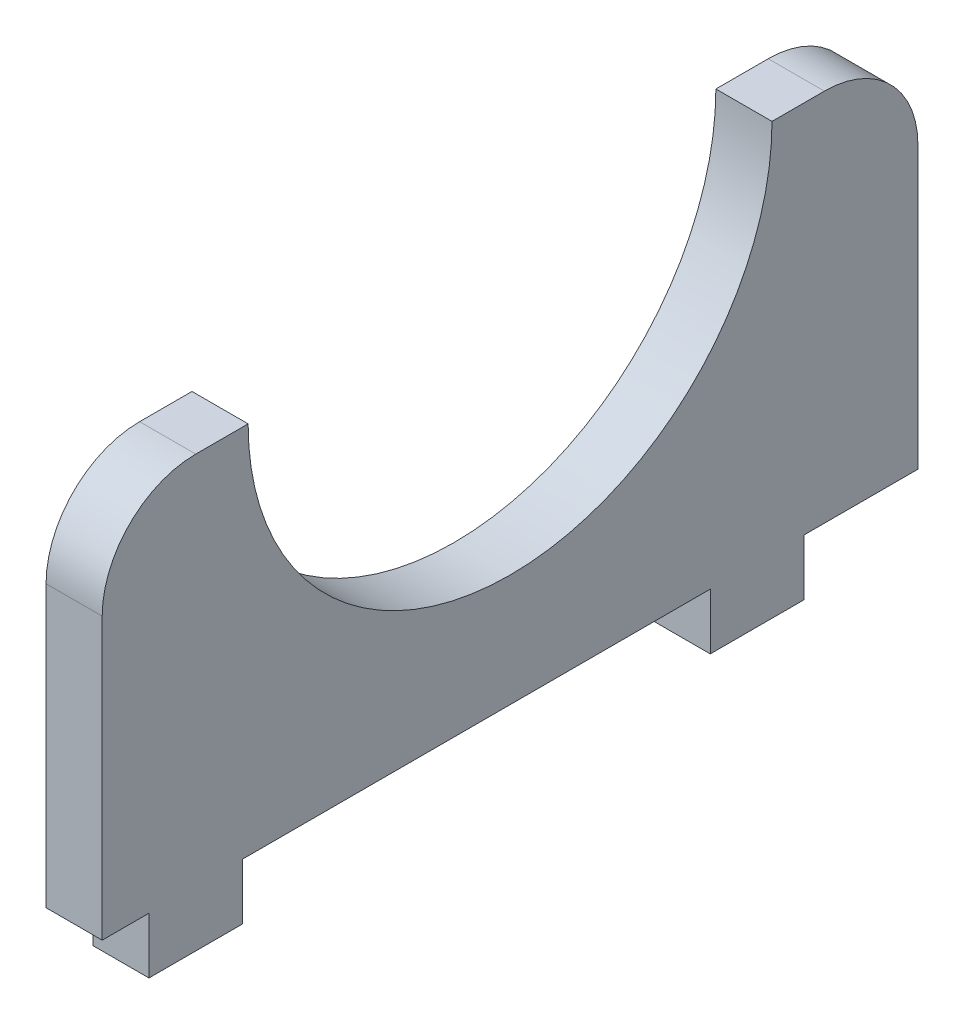
ISO-10303-21;
HEADER;
FILE_DESCRIPTION(('STEP AP214'),'2;1');
FILE_NAME('part.step','',(''),(''),'','','');
FILE_SCHEMA(('AUTOMOTIVE_DESIGN { 1 0 10303 214 1 1 1 1 }'));
ENDSEC;
DATA;
#1=APPLICATION_CONTEXT('core data for automotive mechanical design processes');
#2=APPLICATION_PROTOCOL_DEFINITION('international standard','automotive_design',2000,#1);
#3=PRODUCT_CONTEXT('',#1,'mechanical');
#4=PRODUCT('Part','Part','',(#3));
#5=PRODUCT_RELATED_PRODUCT_CATEGORY('part','',(#4));
#6=PRODUCT_DEFINITION_FORMATION('','',#4);
#7=PRODUCT_DEFINITION_CONTEXT('part definition',#1,'design');
#8=PRODUCT_DEFINITION('design','',#6,#7);
#9=PRODUCT_DEFINITION_SHAPE('','',#8);
#10=(LENGTH_UNIT() NAMED_UNIT(*) SI_UNIT(.MILLI.,.METRE.));
#11=(NAMED_UNIT(*) PLANE_ANGLE_UNIT() SI_UNIT($,.RADIAN.));
#12=(NAMED_UNIT(*) SI_UNIT($,.STERADIAN.) SOLID_ANGLE_UNIT());
#13=UNCERTAINTY_MEASURE_WITH_UNIT(LENGTH_MEASURE(1.E-05),#10,'distance_accuracy_value','');
#14=(GEOMETRIC_REPRESENTATION_CONTEXT(3) GLOBAL_UNCERTAINTY_ASSIGNED_CONTEXT((#13)) GLOBAL_UNIT_ASSIGNED_CONTEXT((#10,
#11,#12)) REPRESENTATION_CONTEXT('',''));
#15=CARTESIAN_POINT('',(0.,0.,0.));
#16=DIRECTION('',(0.,0.,1.));
#17=DIRECTION('',(1.,0.,0.));
#18=AXIS2_PLACEMENT_3D('',#15,#16,#17);
#19=CARTESIAN_POINT('',(3.,-11.75,-13.6));
#20=DIRECTION('',(0.,1.,0.));
#21=DIRECTION('',(0.,0.,1.));
#22=AXIS2_PLACEMENT_3D('',#19,#20,#21);
#23=PLANE('',#22);
#24=DIRECTION('',(-1.,0.,0.));
#25=VECTOR('',#24,1.);
#26=CARTESIAN_POINT('',(3.,-11.75,-2.49999999999999));
#27=LINE('',#26,#25);
#28=CARTESIAN_POINT('',(3.,-11.75,-2.49999999999999));
#29=VERTEX_POINT('',#28);
#30=CARTESIAN_POINT('',(0.,-11.75,-2.49999999999999));
#31=VERTEX_POINT('',#30);
#32=EDGE_CURVE('E58',#29,#31,#27,.T.);
#33=ORIENTED_EDGE('',*,*,#32,.F.);
#34=DIRECTION('',(0.,0.,-1.));
#35=VECTOR('',#34,1.);
#36=CARTESIAN_POINT('',(3.,-11.75,-13.6));
#37=LINE('',#36,#35);
#38=CARTESIAN_POINT('',(3.,-11.75,22.5));
#39=VERTEX_POINT('',#38);
#40=EDGE_CURVE('E172',#39,#29,#37,.T.);
#41=ORIENTED_EDGE('',*,*,#40,.F.);
#42=DIRECTION('',(1.,0.,0.));
#43=VECTOR('',#42,1.);
#44=CARTESIAN_POINT('',(3.,-11.75,22.5));
#45=LINE('',#44,#43);
#46=CARTESIAN_POINT('',(0.,-11.75,22.5));
#47=VERTEX_POINT('',#46);
#48=EDGE_CURVE('E176',#47,#39,#45,.T.);
#49=ORIENTED_EDGE('',*,*,#48,.F.);
#50=DIRECTION('',(0.,0.,-1.));
#51=VECTOR('',#50,1.);
#52=CARTESIAN_POINT('',(0.,-11.75,-13.6));
#53=LINE('',#52,#51);
#54=EDGE_CURVE('E231',#47,#31,#53,.T.);
#55=ORIENTED_EDGE('',*,*,#54,.T.);
#56=EDGE_LOOP('',(#33,#41,#49,#55));
#57=FACE_BOUND('',#56,.T.);
#58=ADVANCED_FACE('F35',(#57),#23,.F.);
#59=DIRECTION('',(1.,0.,0.));
#60=VECTOR('',#59,1.);
#61=CARTESIAN_POINT('',(3.,-11.75,-7.49999999999999));
#62=LINE('',#61,#60);
#63=CARTESIAN_POINT('',(0.,-11.75,-7.49999999999999));
#64=VERTEX_POINT('',#63);
#65=CARTESIAN_POINT('',(3.,-11.75,-7.49999999999999));
#66=VERTEX_POINT('',#65);
#67=EDGE_CURVE('E167',#64,#66,#62,.T.);
#68=ORIENTED_EDGE('',*,*,#67,.F.);
#69=CARTESIAN_POINT('',(0.,-11.75,-13.6));
#70=VERTEX_POINT('',#69);
#71=EDGE_CURVE('E227',#64,#70,#53,.T.);
#72=ORIENTED_EDGE('',*,*,#71,.T.);
#73=DIRECTION('',(-1.,0.,0.));
#74=VECTOR('',#73,1.);
#75=CARTESIAN_POINT('',(3.,-11.75,-13.6));
#76=LINE('',#75,#74);
#77=CARTESIAN_POINT('',(3.,-11.75,-13.6));
#78=VERTEX_POINT('',#77);
#79=EDGE_CURVE('E225',#78,#70,#76,.T.);
#80=ORIENTED_EDGE('',*,*,#79,.F.);
#81=EDGE_CURVE('E50',#66,#78,#37,.T.);
#82=ORIENTED_EDGE('',*,*,#81,.F.);
#83=EDGE_LOOP('',(#68,#72,#80,#82));
#84=FACE_BOUND('',#83,.T.);
#85=ADVANCED_FACE('F288',(#84),#23,.F.);
#86=DIRECTION('',(-1.,0.,0.));
#87=VECTOR('',#86,1.);
#88=CARTESIAN_POINT('',(3.,-11.75,27.5));
#89=LINE('',#88,#87);
#90=CARTESIAN_POINT('',(3.,-11.75,27.5));
#91=VERTEX_POINT('',#90);
#92=CARTESIAN_POINT('',(0.,-11.75,27.5));
#93=VERTEX_POINT('',#92);
#94=EDGE_CURVE('E173',#91,#93,#89,.T.);
#95=ORIENTED_EDGE('',*,*,#94,.F.);
#96=CARTESIAN_POINT('',(3.,-11.75,30.));
#97=VERTEX_POINT('',#96);
#98=EDGE_CURVE('E217',#97,#91,#37,.T.);
#99=ORIENTED_EDGE('',*,*,#98,.F.);
#100=DIRECTION('',(-1.,0.,0.));
#101=VECTOR('',#100,1.);
#102=CARTESIAN_POINT('',(3.,-11.75,30.));
#103=LINE('',#102,#101);
#104=CARTESIAN_POINT('',(0.,-11.75,30.));
#105=VERTEX_POINT('',#104);
#106=EDGE_CURVE('E238',#97,#105,#103,.T.);
#107=ORIENTED_EDGE('',*,*,#106,.T.);
#108=EDGE_CURVE('E228',#105,#93,#53,.T.);
#109=ORIENTED_EDGE('',*,*,#108,.T.);
#110=EDGE_LOOP('',(#95,#99,#107,#109));
#111=FACE_BOUND('',#110,.T.);
#112=ADVANCED_FACE('F275',(#111),#23,.F.);
#113=CARTESIAN_POINT('',(3.,8.25,-13.6));
#114=DIRECTION('',(0.,-1.,0.));
#115=DIRECTION('',(0.,0.,-1.));
#116=AXIS2_PLACEMENT_3D('',#113,#114,#115);
#117=PLANE('',#116);
#118=DIRECTION('',(0.,0.,1.));
#119=VECTOR('',#118,1.);
#120=CARTESIAN_POINT('',(3.,8.25,-13.6));
#121=LINE('',#120,#119);
#122=CARTESIAN_POINT('',(3.,8.25,-8.59999999999999));
#123=VERTEX_POINT('',#122);
#124=CARTESIAN_POINT('',(3.,8.25,-5.79999999999999));
#125=VERTEX_POINT('',#124);
#126=EDGE_CURVE('E223',#123,#125,#121,.T.);
#127=ORIENTED_EDGE('',*,*,#126,.F.);
#128=DIRECTION('',(-1.,0.,0.));
#129=VECTOR('',#128,1.);
#130=CARTESIAN_POINT('',(3.,8.25,-8.59999999999999));
#131=LINE('',#130,#129);
#132=CARTESIAN_POINT('',(0.,8.25,-8.59999999999999));
#133=VERTEX_POINT('',#132);
#134=EDGE_CURVE('E244',#123,#133,#131,.T.);
#135=ORIENTED_EDGE('',*,*,#134,.T.);
#136=DIRECTION('',(0.,0.,1.));
#137=VECTOR('',#136,1.);
#138=CARTESIAN_POINT('',(0.,8.25,-13.6));
#139=LINE('',#138,#137);
#140=CARTESIAN_POINT('',(0.,8.25,-5.79999999999999));
#141=VERTEX_POINT('',#140);
#142=EDGE_CURVE('E216',#133,#141,#139,.T.);
#143=ORIENTED_EDGE('',*,*,#142,.T.);
#144=DIRECTION('',(1.,0.,0.));
#145=VECTOR('',#144,1.);
#146=CARTESIAN_POINT('',(0.,8.25,-5.79999999999999));
#147=LINE('',#146,#145);
#148=EDGE_CURVE('E210',#141,#125,#147,.T.);
#149=ORIENTED_EDGE('',*,*,#148,.T.);
#150=EDGE_LOOP('',(#127,#135,#143,#149));
#151=FACE_BOUND('',#150,.T.);
#152=ADVANCED_FACE('F302',(#151),#117,.F.);
#153=CARTESIAN_POINT('',(3.,-11.75,30.));
#154=DIRECTION('',(0.,0.,-1.));
#155=DIRECTION('',(-1.,0.,0.));
#156=AXIS2_PLACEMENT_3D('',#153,#154,#155);
#157=PLANE('',#156);
#158=DIRECTION('',(0.,-1.,0.));
#159=VECTOR('',#158,1.);
#160=CARTESIAN_POINT('',(3.,-11.75,30.));
#161=LINE('',#160,#159);
#162=CARTESIAN_POINT('',(3.,3.25,30.));
#163=VERTEX_POINT('',#162);
#164=EDGE_CURVE('E214',#163,#97,#161,.T.);
#165=ORIENTED_EDGE('',*,*,#164,.F.);
#166=DIRECTION('',(-1.,0.,0.));
#167=VECTOR('',#166,1.);
#168=CARTESIAN_POINT('',(3.,3.25,30.));
#169=LINE('',#168,#167);
#170=CARTESIAN_POINT('',(0.,3.25,30.));
#171=VERTEX_POINT('',#170);
#172=EDGE_CURVE('E43',#163,#171,#169,.T.);
#173=ORIENTED_EDGE('',*,*,#172,.T.);
#174=DIRECTION('',(0.,-1.,0.));
#175=VECTOR('',#174,1.);
#176=CARTESIAN_POINT('',(0.,-11.75,30.));
#177=LINE('',#176,#175);
#178=EDGE_CURVE('E213',#171,#105,#177,.T.);
#179=ORIENTED_EDGE('',*,*,#178,.T.);
#180=ORIENTED_EDGE('',*,*,#106,.F.);
#181=EDGE_LOOP('',(#165,#173,#179,#180));
#182=FACE_BOUND('',#181,.T.);
#183=ADVANCED_FACE('F261',(#182),#157,.F.);
#184=CARTESIAN_POINT('',(3.,-11.75,-13.6));
#185=DIRECTION('',(0.,0.,1.));
#186=DIRECTION('',(1.,0.,0.));
#187=AXIS2_PLACEMENT_3D('',#184,#185,#186);
#188=PLANE('',#187);
#189=DIRECTION('',(0.,1.,0.));
#190=VECTOR('',#189,1.);
#191=CARTESIAN_POINT('',(0.,-11.75,-13.6));
#192=LINE('',#191,#190);
#193=CARTESIAN_POINT('',(0.,3.25,-13.6));
#194=VERTEX_POINT('',#193);
#195=EDGE_CURVE('E230',#70,#194,#192,.T.);
#196=ORIENTED_EDGE('',*,*,#195,.T.);
#197=DIRECTION('',(-1.,0.,0.));
#198=VECTOR('',#197,1.);
#199=CARTESIAN_POINT('',(3.,3.25,-13.6));
#200=LINE('',#199,#198);
#201=CARTESIAN_POINT('',(3.,3.25,-13.6));
#202=VERTEX_POINT('',#201);
#203=EDGE_CURVE('E251',#194,#202,#200,.F.);
#204=ORIENTED_EDGE('',*,*,#203,.T.);
#205=DIRECTION('',(0.,1.,0.));
#206=VECTOR('',#205,1.);
#207=CARTESIAN_POINT('',(3.,-11.75,-13.6));
#208=LINE('',#207,#206);
#209=EDGE_CURVE('E220',#78,#202,#208,.T.);
#210=ORIENTED_EDGE('',*,*,#209,.F.);
#211=ORIENTED_EDGE('',*,*,#79,.T.);
#212=EDGE_LOOP('',(#196,#204,#210,#211));
#213=FACE_BOUND('',#212,.T.);
#214=ADVANCED_FACE('F294',(#213),#188,.F.);
#215=CARTESIAN_POINT('',(0.,8.25,22.2));
#216=VERTEX_POINT('',#215);
#217=CARTESIAN_POINT('',(0.,8.25,25.));
#218=VERTEX_POINT('',#217);
#219=EDGE_CURVE('E234',#216,#218,#139,.T.);
#220=ORIENTED_EDGE('',*,*,#219,.T.);
#221=DIRECTION('',(-1.,0.,0.));
#222=VECTOR('',#221,1.);
#223=CARTESIAN_POINT('',(3.,8.25,25.));
#224=LINE('',#223,#222);
#225=CARTESIAN_POINT('',(3.,8.25,25.));
#226=VERTEX_POINT('',#225);
#227=EDGE_CURVE('E11',#218,#226,#224,.F.);
#228=ORIENTED_EDGE('',*,*,#227,.T.);
#229=CARTESIAN_POINT('',(3.,8.25,22.2));
#230=VERTEX_POINT('',#229);
#231=EDGE_CURVE('E222',#230,#226,#121,.T.);
#232=ORIENTED_EDGE('',*,*,#231,.F.);
#233=DIRECTION('',(1.,0.,0.));
#234=VECTOR('',#233,1.);
#235=CARTESIAN_POINT('',(0.,8.25,22.2));
#236=LINE('',#235,#234);
#237=EDGE_CURVE('E207',#230,#216,#236,.F.);
#238=ORIENTED_EDGE('',*,*,#237,.T.);
#239=EDGE_LOOP('',(#220,#228,#232,#238));
#240=FACE_BOUND('',#239,.T.);
#241=ADVANCED_FACE('F310',(#240),#117,.F.);
#242=CARTESIAN_POINT('',(3.,0.,0.));
#243=DIRECTION('',(1.,0.,0.));
#244=DIRECTION('',(0.,0.,-1.));
#245=AXIS2_PLACEMENT_3D('',#242,#243,#244);
#246=PLANE('',#245);
#247=ORIENTED_EDGE('',*,*,#209,.T.);
#248=CARTESIAN_POINT('',(3.,3.25,-8.59999999999999));
#249=DIRECTION('',(1.,0.,0.));
#250=DIRECTION('',(0.,0.,-1.));
#251=AXIS2_PLACEMENT_3D('',#248,#249,#250);
#252=CIRCLE('',#251,5.);
#253=EDGE_CURVE('E255',#202,#123,#252,.T.);
#254=ORIENTED_EDGE('',*,*,#253,.T.);
#255=ORIENTED_EDGE('',*,*,#126,.T.);
#256=CARTESIAN_POINT('',(3.,8.25,8.20000000000001));
#257=DIRECTION('',(1.,0.,0.));
#258=DIRECTION('',(0.,0.,-1.));
#259=AXIS2_PLACEMENT_3D('',#256,#257,#258);
#260=CIRCLE('',#259,14.);
#261=EDGE_CURVE('E204',#230,#125,#260,.T.);
#262=ORIENTED_EDGE('',*,*,#261,.F.);
#263=ORIENTED_EDGE('',*,*,#231,.T.);
#264=CARTESIAN_POINT('',(3.,3.25,25.));
#265=DIRECTION('',(1.,0.,0.));
#266=DIRECTION('',(0.,0.,-1.));
#267=AXIS2_PLACEMENT_3D('',#264,#265,#266);
#268=CIRCLE('',#267,5.);
#269=EDGE_CURVE('E253',#226,#163,#268,.T.);
#270=ORIENTED_EDGE('',*,*,#269,.T.);
#271=ORIENTED_EDGE('',*,*,#164,.T.);
#272=ORIENTED_EDGE('',*,*,#98,.T.);
#273=DIRECTION('',(0.,1.,0.));
#274=VECTOR('',#273,1.);
#275=CARTESIAN_POINT('',(3.,-14.75,27.5));
#276=LINE('',#275,#274);
#277=CARTESIAN_POINT('',(3.,-14.75,27.5));
#278=VERTEX_POINT('',#277);
#279=EDGE_CURVE('E201',#278,#91,#276,.T.);
#280=ORIENTED_EDGE('',*,*,#279,.F.);
#281=DIRECTION('',(0.,0.,1.));
#282=VECTOR('',#281,1.);
#283=CARTESIAN_POINT('',(3.,-14.75,27.5));
#284=LINE('',#283,#282);
#285=CARTESIAN_POINT('',(3.,-14.75,22.5));
#286=VERTEX_POINT('',#285);
#287=EDGE_CURVE('E182',#286,#278,#284,.T.);
#288=ORIENTED_EDGE('',*,*,#287,.F.);
#289=DIRECTION('',(0.,1.,0.));
#290=VECTOR('',#289,1.);
#291=CARTESIAN_POINT('',(3.,-14.75,22.5));
#292=LINE('',#291,#290);
#293=EDGE_CURVE('E190',#286,#39,#292,.T.);
#294=ORIENTED_EDGE('',*,*,#293,.T.);
#295=ORIENTED_EDGE('',*,*,#40,.T.);
#296=DIRECTION('',(0.,1.,0.));
#297=VECTOR('',#296,1.);
#298=CARTESIAN_POINT('',(3.,-14.75,-2.49999999999999));
#299=LINE('',#298,#297);
#300=CARTESIAN_POINT('',(3.,-14.75,-2.49999999999999));
#301=VERTEX_POINT('',#300);
#302=EDGE_CURVE('E152',#301,#29,#299,.T.);
#303=ORIENTED_EDGE('',*,*,#302,.F.);
#304=DIRECTION('',(0.,0.,1.));
#305=VECTOR('',#304,1.);
#306=CARTESIAN_POINT('',(3.,-14.75,-2.49999999999999));
#307=LINE('',#306,#305);
#308=CARTESIAN_POINT('',(3.,-14.75,-7.49999999999999));
#309=VERTEX_POINT('',#308);
#310=EDGE_CURVE('E158',#309,#301,#307,.T.);
#311=ORIENTED_EDGE('',*,*,#310,.F.);
#312=DIRECTION('',(0.,1.,0.));
#313=VECTOR('',#312,1.);
#314=CARTESIAN_POINT('',(3.,-14.75,-7.49999999999999));
#315=LINE('',#314,#313);
#316=EDGE_CURVE('E454',#309,#66,#315,.T.);
#317=ORIENTED_EDGE('',*,*,#316,.T.);
#318=ORIENTED_EDGE('',*,*,#81,.T.);
#319=EDGE_LOOP('',(#247,#254,#255,#262,#263,#270,#271,#272,#280,#288,#294,#295,#303,#311,#317,#318));
#320=FACE_BOUND('',#319,.T.);
#321=ADVANCED_FACE('F170',(#320),#246,.T.);
#322=CARTESIAN_POINT('',(0.,0.,0.));
#323=DIRECTION('',(1.,0.,0.));
#324=DIRECTION('',(0.,0.,-1.));
#325=AXIS2_PLACEMENT_3D('',#322,#323,#324);
#326=PLANE('',#325);
#327=ORIENTED_EDGE('',*,*,#142,.F.);
#328=CARTESIAN_POINT('',(0.,3.25,-8.59999999999999));
#329=DIRECTION('',(1.,0.,0.));
#330=DIRECTION('',(0.,0.,-1.));
#331=AXIS2_PLACEMENT_3D('',#328,#329,#330);
#332=CIRCLE('',#331,5.);
#333=EDGE_CURVE('E249',#133,#194,#332,.F.);
#334=ORIENTED_EDGE('',*,*,#333,.T.);
#335=ORIENTED_EDGE('',*,*,#195,.F.);
#336=ORIENTED_EDGE('',*,*,#71,.F.);
#337=DIRECTION('',(0.,1.,0.));
#338=VECTOR('',#337,1.);
#339=CARTESIAN_POINT('',(0.,-14.75,-7.49999999999999));
#340=LINE('',#339,#338);
#341=CARTESIAN_POINT('',(0.,-14.75,-7.49999999999999));
#342=VERTEX_POINT('',#341);
#343=EDGE_CURVE('E178',#342,#64,#340,.T.);
#344=ORIENTED_EDGE('',*,*,#343,.F.);
#345=DIRECTION('',(0.,0.,-1.));
#346=VECTOR('',#345,1.);
#347=CARTESIAN_POINT('',(0.,-14.75,-2.49999999999999));
#348=LINE('',#347,#346);
#349=CARTESIAN_POINT('',(0.,-14.75,-2.49999999999999));
#350=VERTEX_POINT('',#349);
#351=EDGE_CURVE('E157',#350,#342,#348,.T.);
#352=ORIENTED_EDGE('',*,*,#351,.F.);
#353=DIRECTION('',(0.,1.,0.));
#354=VECTOR('',#353,1.);
#355=CARTESIAN_POINT('',(0.,-14.75,-2.49999999999999));
#356=LINE('',#355,#354);
#357=EDGE_CURVE('E154',#350,#31,#356,.T.);
#358=ORIENTED_EDGE('',*,*,#357,.T.);
#359=ORIENTED_EDGE('',*,*,#54,.F.);
#360=DIRECTION('',(0.,1.,0.));
#361=VECTOR('',#360,1.);
#362=CARTESIAN_POINT('',(0.,-14.75,22.5));
#363=LINE('',#362,#361);
#364=CARTESIAN_POINT('',(0.,-14.75,22.5));
#365=VERTEX_POINT('',#364);
#366=EDGE_CURVE('E195',#365,#47,#363,.T.);
#367=ORIENTED_EDGE('',*,*,#366,.F.);
#368=DIRECTION('',(0.,0.,-1.));
#369=VECTOR('',#368,1.);
#370=CARTESIAN_POINT('',(0.,-14.75,27.5));
#371=LINE('',#370,#369);
#372=CARTESIAN_POINT('',(0.,-14.75,27.5));
#373=VERTEX_POINT('',#372);
#374=EDGE_CURVE('E187',#373,#365,#371,.T.);
#375=ORIENTED_EDGE('',*,*,#374,.F.);
#376=DIRECTION('',(0.,1.,0.));
#377=VECTOR('',#376,1.);
#378=CARTESIAN_POINT('',(0.,-14.75,27.5));
#379=LINE('',#378,#377);
#380=EDGE_CURVE('E198',#373,#93,#379,.T.);
#381=ORIENTED_EDGE('',*,*,#380,.T.);
#382=ORIENTED_EDGE('',*,*,#108,.F.);
#383=ORIENTED_EDGE('',*,*,#178,.F.);
#384=CARTESIAN_POINT('',(0.,3.25,25.));
#385=DIRECTION('',(1.,0.,0.));
#386=DIRECTION('',(0.,0.,-1.));
#387=AXIS2_PLACEMENT_3D('',#384,#385,#386);
#388=CIRCLE('',#387,5.);
#389=EDGE_CURVE('E247',#171,#218,#388,.F.);
#390=ORIENTED_EDGE('',*,*,#389,.T.);
#391=ORIENTED_EDGE('',*,*,#219,.F.);
#392=CARTESIAN_POINT('',(0.,8.25,8.20000000000001));
#393=DIRECTION('',(1.,0.,0.));
#394=DIRECTION('',(0.,0.,-1.));
#395=AXIS2_PLACEMENT_3D('',#392,#393,#394);
#396=CIRCLE('',#395,14.);
#397=EDGE_CURVE('E241',#216,#141,#396,.T.);
#398=ORIENTED_EDGE('',*,*,#397,.T.);
#399=EDGE_LOOP('',(#327,#334,#335,#336,#344,#352,#358,#359,#367,#375,#381,#382,#383,#390,#391,#398));
#400=FACE_BOUND('',#399,.T.);
#401=ADVANCED_FACE('F268',(#400),#326,.F.);
#402=CARTESIAN_POINT('',(0.,8.25,8.20000000000001));
#403=DIRECTION('',(1.,0.,0.));
#404=DIRECTION('',(0.,0.,-1.));
#405=AXIS2_PLACEMENT_3D('',#402,#403,#404);
#406=CYLINDRICAL_SURFACE('',#405,14.);
#407=ORIENTED_EDGE('',*,*,#397,.F.);
#408=ORIENTED_EDGE('',*,*,#237,.F.);
#409=ORIENTED_EDGE('',*,*,#261,.T.);
#410=ORIENTED_EDGE('',*,*,#148,.F.);
#411=EDGE_LOOP('',(#407,#408,#409,#410));
#412=FACE_BOUND('',#411,.T.);
#413=ADVANCED_FACE('F308',(#412),#406,.F.);
#414=CARTESIAN_POINT('',(3.,3.25,-8.59999999999999));
#415=DIRECTION('',(-1.,0.,0.));
#416=DIRECTION('',(0.,0.,1.));
#417=AXIS2_PLACEMENT_3D('',#414,#415,#416);
#418=CYLINDRICAL_SURFACE('',#417,5.);
#419=ORIENTED_EDGE('',*,*,#253,.F.);
#420=ORIENTED_EDGE('',*,*,#203,.F.);
#421=ORIENTED_EDGE('',*,*,#333,.F.);
#422=ORIENTED_EDGE('',*,*,#134,.F.);
#423=EDGE_LOOP('',(#419,#420,#421,#422));
#424=FACE_BOUND('',#423,.T.);
#425=ADVANCED_FACE('F299',(#424),#418,.T.);
#426=CARTESIAN_POINT('',(3.,3.25,25.));
#427=DIRECTION('',(-1.,0.,0.));
#428=DIRECTION('',(0.,0.,1.));
#429=AXIS2_PLACEMENT_3D('',#426,#427,#428);
#430=CYLINDRICAL_SURFACE('',#429,5.);
#431=ORIENTED_EDGE('',*,*,#269,.F.);
#432=ORIENTED_EDGE('',*,*,#227,.F.);
#433=ORIENTED_EDGE('',*,*,#389,.F.);
#434=ORIENTED_EDGE('',*,*,#172,.F.);
#435=EDGE_LOOP('',(#431,#432,#433,#434));
#436=FACE_BOUND('',#435,.T.);
#437=ADVANCED_FACE('F37',(#436),#430,.T.);
#438=CARTESIAN_POINT('',(3.,-14.75,27.5));
#439=DIRECTION('',(0.,0.,-1.));
#440=DIRECTION('',(0.,1.,0.));
#441=AXIS2_PLACEMENT_3D('',#438,#439,#440);
#442=PLANE('',#441);
#443=ORIENTED_EDGE('',*,*,#94,.T.);
#444=ORIENTED_EDGE('',*,*,#380,.F.);
#445=DIRECTION('',(-1.,0.,0.));
#446=VECTOR('',#445,1.);
#447=CARTESIAN_POINT('',(3.,-14.75,27.5));
#448=LINE('',#447,#446);
#449=EDGE_CURVE('E185',#278,#373,#448,.T.);
#450=ORIENTED_EDGE('',*,*,#449,.F.);
#451=ORIENTED_EDGE('',*,*,#279,.T.);
#452=EDGE_LOOP('',(#443,#444,#450,#451));
#453=FACE_BOUND('',#452,.T.);
#454=ADVANCED_FACE('F279',(#453),#442,.F.);
#455=CARTESIAN_POINT('',(3.,-14.75,22.5));
#456=DIRECTION('',(0.,0.,1.));
#457=DIRECTION('',(0.,-1.,0.));
#458=AXIS2_PLACEMENT_3D('',#455,#456,#457);
#459=PLANE('',#458);
#460=ORIENTED_EDGE('',*,*,#48,.T.);
#461=ORIENTED_EDGE('',*,*,#293,.F.);
#462=DIRECTION('',(1.,0.,0.));
#463=VECTOR('',#462,1.);
#464=CARTESIAN_POINT('',(3.,-14.75,22.5));
#465=LINE('',#464,#463);
#466=EDGE_CURVE('E189',#365,#286,#465,.T.);
#467=ORIENTED_EDGE('',*,*,#466,.F.);
#468=ORIENTED_EDGE('',*,*,#366,.T.);
#469=EDGE_LOOP('',(#460,#461,#467,#468));
#470=FACE_BOUND('',#469,.T.);
#471=ADVANCED_FACE('F285',(#470),#459,.F.);
#472=CARTESIAN_POINT('',(0.,-14.75,0.));
#473=DIRECTION('',(0.,1.,0.));
#474=DIRECTION('',(0.,0.,1.));
#475=AXIS2_PLACEMENT_3D('',#472,#473,#474);
#476=PLANE('',#475);
#477=ORIENTED_EDGE('',*,*,#287,.T.);
#478=ORIENTED_EDGE('',*,*,#449,.T.);
#479=ORIENTED_EDGE('',*,*,#374,.T.);
#480=ORIENTED_EDGE('',*,*,#466,.T.);
#481=EDGE_LOOP('',(#477,#478,#479,#480));
#482=FACE_BOUND('',#481,.T.);
#483=ADVANCED_FACE('F281',(#482),#476,.F.);
#484=CARTESIAN_POINT('',(3.,-14.75,-2.49999999999999));
#485=DIRECTION('',(0.,0.,-1.));
#486=DIRECTION('',(0.,1.,0.));
#487=AXIS2_PLACEMENT_3D('',#484,#485,#486);
#488=PLANE('',#487);
#489=ORIENTED_EDGE('',*,*,#32,.T.);
#490=ORIENTED_EDGE('',*,*,#357,.F.);
#491=DIRECTION('',(-1.,0.,0.));
#492=VECTOR('',#491,1.);
#493=CARTESIAN_POINT('',(3.,-14.75,-2.49999999999999));
#494=LINE('',#493,#492);
#495=EDGE_CURVE('E148',#301,#350,#494,.T.);
#496=ORIENTED_EDGE('',*,*,#495,.F.);
#497=ORIENTED_EDGE('',*,*,#302,.T.);
#498=EDGE_LOOP('',(#489,#490,#496,#497));
#499=FACE_BOUND('',#498,.T.);
#500=ADVANCED_FACE('F150',(#499),#488,.F.);
#501=CARTESIAN_POINT('',(3.,-14.75,-7.49999999999999));
#502=DIRECTION('',(0.,0.,1.));
#503=DIRECTION('',(0.,-1.,0.));
#504=AXIS2_PLACEMENT_3D('',#501,#502,#503);
#505=PLANE('',#504);
#506=ORIENTED_EDGE('',*,*,#67,.T.);
#507=ORIENTED_EDGE('',*,*,#316,.F.);
#508=DIRECTION('',(1.,0.,0.));
#509=VECTOR('',#508,1.);
#510=CARTESIAN_POINT('',(3.,-14.75,-7.49999999999999));
#511=LINE('',#510,#509);
#512=EDGE_CURVE('E163',#342,#309,#511,.T.);
#513=ORIENTED_EDGE('',*,*,#512,.F.);
#514=ORIENTED_EDGE('',*,*,#343,.T.);
#515=EDGE_LOOP('',(#506,#507,#513,#514));
#516=FACE_BOUND('',#515,.T.);
#517=ADVANCED_FACE('F433',(#516),#505,.F.);
#518=CARTESIAN_POINT('',(0.,-14.75,-30.));
#519=DIRECTION('',(0.,1.,0.));
#520=DIRECTION('',(0.,0.,1.));
#521=AXIS2_PLACEMENT_3D('',#518,#519,#520);
#522=PLANE('',#521);
#523=ORIENTED_EDGE('',*,*,#310,.T.);
#524=ORIENTED_EDGE('',*,*,#495,.T.);
#525=ORIENTED_EDGE('',*,*,#351,.T.);
#526=ORIENTED_EDGE('',*,*,#512,.T.);
#527=EDGE_LOOP('',(#523,#524,#525,#526));
#528=FACE_BOUND('',#527,.T.);
#529=ADVANCED_FACE('F161',(#528),#522,.F.);
#530=CLOSED_SHELL('',(#58,#85,#112,#152,#183,#214,#241,#321,#401,#413,#425,#437,#454,#471,#483,
#500,#517,#529));
#531=MANIFOLD_SOLID_BREP('B2',#530);
#532=ADVANCED_BREP_SHAPE_REPRESENTATION('',(#18,#531),#14);
#533=SHAPE_DEFINITION_REPRESENTATION(#9,#532);
ENDSEC;
END-ISO-10303-21;
